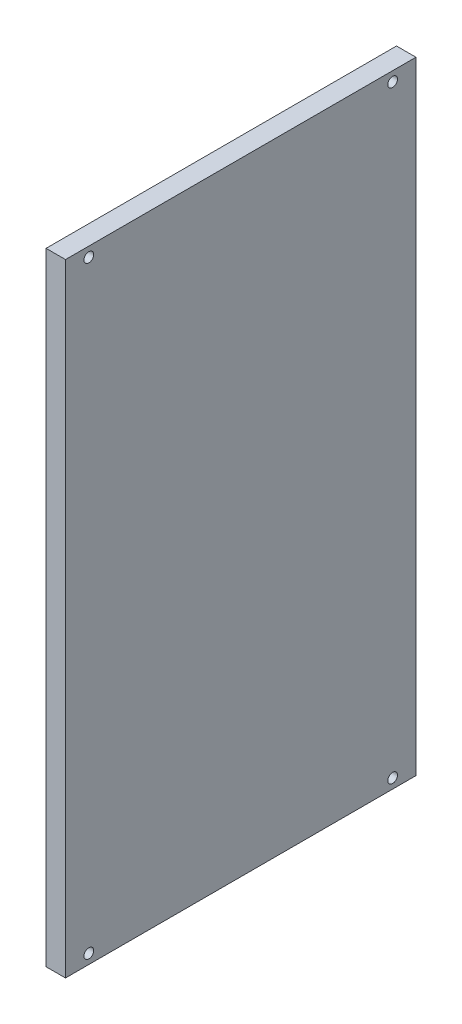
ISO-10303-21;
HEADER;
FILE_DESCRIPTION(('STEP AP214'),'2;1');
FILE_NAME('part.step','',(''),(''),'','','');
FILE_SCHEMA(('AUTOMOTIVE_DESIGN { 1 0 10303 214 1 1 1 1 }'));
ENDSEC;
DATA;
#1=APPLICATION_CONTEXT('core data for automotive mechanical design processes');
#2=APPLICATION_PROTOCOL_DEFINITION('international standard','automotive_design',2000,#1);
#3=PRODUCT_CONTEXT('',#1,'mechanical');
#4=PRODUCT('Part','Part','',(#3));
#5=PRODUCT_RELATED_PRODUCT_CATEGORY('part','',(#4));
#6=PRODUCT_DEFINITION_FORMATION('','',#4);
#7=PRODUCT_DEFINITION_CONTEXT('part definition',#1,'design');
#8=PRODUCT_DEFINITION('design','',#6,#7);
#9=PRODUCT_DEFINITION_SHAPE('','',#8);
#10=(LENGTH_UNIT() NAMED_UNIT(*) SI_UNIT(.MILLI.,.METRE.));
#11=(NAMED_UNIT(*) PLANE_ANGLE_UNIT() SI_UNIT($,.RADIAN.));
#12=(NAMED_UNIT(*) SI_UNIT($,.STERADIAN.) SOLID_ANGLE_UNIT());
#13=UNCERTAINTY_MEASURE_WITH_UNIT(LENGTH_MEASURE(1.E-05),#10,'distance_accuracy_value','');
#14=(GEOMETRIC_REPRESENTATION_CONTEXT(3) GLOBAL_UNCERTAINTY_ASSIGNED_CONTEXT((#13)) GLOBAL_UNIT_ASSIGNED_CONTEXT((#10,
#11,#12)) REPRESENTATION_CONTEXT('',''));
#15=CARTESIAN_POINT('',(0.,0.,0.));
#16=DIRECTION('',(0.,0.,1.));
#17=DIRECTION('',(1.,0.,0.));
#18=AXIS2_PLACEMENT_3D('',#15,#16,#17);
#19=CARTESIAN_POINT('',(10.,0.,0.));
#20=DIRECTION('',(1.,0.,0.));
#21=DIRECTION('',(0.,0.,-1.));
#22=AXIS2_PLACEMENT_3D('',#19,#20,#21);
#23=PLANE('',#22);
#24=CARTESIAN_POINT('',(10.,-155.065,78.15));
#25=DIRECTION('',(1.,0.,0.));
#26=DIRECTION('',(0.,0.,-1.));
#27=AXIS2_PLACEMENT_3D('',#24,#25,#26);
#28=CIRCLE('',#27,2.5);
#29=CARTESIAN_POINT('',(10.,-155.065,75.65));
#30=VERTEX_POINT('',#29);
#31=EDGE_CURVE('E131',#30,#30,#28,.T.);
#32=ORIENTED_EDGE('',*,*,#31,.F.);
#33=EDGE_LOOP('',(#32));
#34=FACE_BOUND('',#33,.T.);
#35=CARTESIAN_POINT('',(10.,155.065,78.15));
#36=DIRECTION('',(1.,0.,0.));
#37=DIRECTION('',(0.,0.,-1.));
#38=AXIS2_PLACEMENT_3D('',#35,#36,#37);
#39=CIRCLE('',#38,2.5);
#40=CARTESIAN_POINT('',(10.,155.065,75.65));
#41=VERTEX_POINT('',#40);
#42=EDGE_CURVE('E110',#41,#41,#39,.T.);
#43=ORIENTED_EDGE('',*,*,#42,.F.);
#44=EDGE_LOOP('',(#43));
#45=FACE_BOUND('',#44,.T.);
#46=DIRECTION('',(0.,0.,1.));
#47=VECTOR('',#46,1.);
#48=CARTESIAN_POINT('',(10.,160.065,-90.15));
#49=LINE('',#48,#47);
#50=CARTESIAN_POINT('',(10.,160.065,-90.15));
#51=VERTEX_POINT('',#50);
#52=CARTESIAN_POINT('',(10.,160.065,90.15));
#53=VERTEX_POINT('',#52);
#54=EDGE_CURVE('E95',#51,#53,#49,.T.);
#55=ORIENTED_EDGE('',*,*,#54,.T.);
#56=DIRECTION('',(0.,-1.,0.));
#57=VECTOR('',#56,1.);
#58=CARTESIAN_POINT('',(10.,160.065,90.15));
#59=LINE('',#58,#57);
#60=CARTESIAN_POINT('',(10.,-160.065,90.15));
#61=VERTEX_POINT('',#60);
#62=EDGE_CURVE('E90',#53,#61,#59,.T.);
#63=ORIENTED_EDGE('',*,*,#62,.T.);
#64=DIRECTION('',(0.,0.,-1.));
#65=VECTOR('',#64,1.);
#66=CARTESIAN_POINT('',(10.,-160.065,90.15));
#67=LINE('',#66,#65);
#68=CARTESIAN_POINT('',(10.,-160.065,-90.15));
#69=VERTEX_POINT('',#68);
#70=EDGE_CURVE('E93',#61,#69,#67,.T.);
#71=ORIENTED_EDGE('',*,*,#70,.T.);
#72=DIRECTION('',(0.,1.,0.));
#73=VECTOR('',#72,1.);
#74=CARTESIAN_POINT('',(10.,-160.065,-90.15));
#75=LINE('',#74,#73);
#76=EDGE_CURVE('E60',#69,#51,#75,.T.);
#77=ORIENTED_EDGE('',*,*,#76,.T.);
#78=EDGE_LOOP('',(#55,#63,#71,#77));
#79=FACE_BOUND('',#78,.T.);
#80=CARTESIAN_POINT('',(10.,155.065,-78.15));
#81=DIRECTION('',(1.,0.,0.));
#82=DIRECTION('',(0.,0.,-1.));
#83=AXIS2_PLACEMENT_3D('',#80,#81,#82);
#84=CIRCLE('',#83,2.50000000000001);
#85=CARTESIAN_POINT('',(10.,155.065,-80.65));
#86=VERTEX_POINT('',#85);
#87=EDGE_CURVE('E125',#86,#86,#84,.T.);
#88=ORIENTED_EDGE('',*,*,#87,.F.);
#89=EDGE_LOOP('',(#88));
#90=FACE_BOUND('',#89,.T.);
#91=CARTESIAN_POINT('',(10.,-155.065,-78.15));
#92=DIRECTION('',(1.,0.,0.));
#93=DIRECTION('',(0.,0.,-1.));
#94=AXIS2_PLACEMENT_3D('',#91,#92,#93);
#95=CIRCLE('',#94,2.5);
#96=CARTESIAN_POINT('',(10.,-155.065,-80.65));
#97=VERTEX_POINT('',#96);
#98=EDGE_CURVE('E137',#97,#97,#95,.T.);
#99=ORIENTED_EDGE('',*,*,#98,.F.);
#100=EDGE_LOOP('',(#99));
#101=FACE_BOUND('',#100,.T.);
#102=ADVANCED_FACE('F43',(#34,#45,#79,#90,#101),#23,.T.);
#103=CARTESIAN_POINT('',(0.,0.,0.));
#104=DIRECTION('',(1.,0.,0.));
#105=DIRECTION('',(0.,0.,-1.));
#106=AXIS2_PLACEMENT_3D('',#103,#104,#105);
#107=PLANE('',#106);
#108=DIRECTION('',(0.,0.,1.));
#109=VECTOR('',#108,1.);
#110=CARTESIAN_POINT('',(0.,160.065,-90.15));
#111=LINE('',#110,#109);
#112=CARTESIAN_POINT('',(0.,160.065,-90.15));
#113=VERTEX_POINT('',#112);
#114=CARTESIAN_POINT('',(0.,160.065,90.15));
#115=VERTEX_POINT('',#114);
#116=EDGE_CURVE('E107',#113,#115,#111,.T.);
#117=ORIENTED_EDGE('',*,*,#116,.F.);
#118=DIRECTION('',(0.,1.,0.));
#119=VECTOR('',#118,1.);
#120=CARTESIAN_POINT('',(0.,-160.065,-90.15));
#121=LINE('',#120,#119);
#122=CARTESIAN_POINT('',(0.,-160.065,-90.15));
#123=VERTEX_POINT('',#122);
#124=EDGE_CURVE('E83',#123,#113,#121,.T.);
#125=ORIENTED_EDGE('',*,*,#124,.F.);
#126=DIRECTION('',(0.,0.,-1.));
#127=VECTOR('',#126,1.);
#128=CARTESIAN_POINT('',(0.,-160.065,90.15));
#129=LINE('',#128,#127);
#130=CARTESIAN_POINT('',(0.,-160.065,90.15));
#131=VERTEX_POINT('',#130);
#132=EDGE_CURVE('E77',#131,#123,#129,.T.);
#133=ORIENTED_EDGE('',*,*,#132,.F.);
#134=DIRECTION('',(0.,-1.,0.));
#135=VECTOR('',#134,1.);
#136=CARTESIAN_POINT('',(0.,160.065,90.15));
#137=LINE('',#136,#135);
#138=EDGE_CURVE('E99',#115,#131,#137,.T.);
#139=ORIENTED_EDGE('',*,*,#138,.F.);
#140=EDGE_LOOP('',(#117,#125,#133,#139));
#141=FACE_BOUND('',#140,.T.);
#142=CARTESIAN_POINT('',(0.,155.065,78.15));
#143=DIRECTION('',(1.,0.,0.));
#144=DIRECTION('',(0.,0.,-1.));
#145=AXIS2_PLACEMENT_3D('',#142,#143,#144);
#146=CIRCLE('',#145,2.5);
#147=CARTESIAN_POINT('',(0.,155.065,75.65));
#148=VERTEX_POINT('',#147);
#149=EDGE_CURVE('E122',#148,#148,#146,.T.);
#150=ORIENTED_EDGE('',*,*,#149,.T.);
#151=EDGE_LOOP('',(#150));
#152=FACE_BOUND('',#151,.T.);
#153=CARTESIAN_POINT('',(0.,155.065,-78.15));
#154=DIRECTION('',(1.,0.,0.));
#155=DIRECTION('',(0.,0.,-1.));
#156=AXIS2_PLACEMENT_3D('',#153,#154,#155);
#157=CIRCLE('',#156,2.50000000000001);
#158=CARTESIAN_POINT('',(0.,155.065,-80.65));
#159=VERTEX_POINT('',#158);
#160=EDGE_CURVE('E128',#159,#159,#157,.T.);
#161=ORIENTED_EDGE('',*,*,#160,.T.);
#162=EDGE_LOOP('',(#161));
#163=FACE_BOUND('',#162,.T.);
#164=CARTESIAN_POINT('',(0.,-155.065,78.15));
#165=DIRECTION('',(1.,0.,0.));
#166=DIRECTION('',(0.,0.,-1.));
#167=AXIS2_PLACEMENT_3D('',#164,#165,#166);
#168=CIRCLE('',#167,2.5);
#169=CARTESIAN_POINT('',(0.,-155.065,75.65));
#170=VERTEX_POINT('',#169);
#171=EDGE_CURVE('E134',#170,#170,#168,.T.);
#172=ORIENTED_EDGE('',*,*,#171,.T.);
#173=EDGE_LOOP('',(#172));
#174=FACE_BOUND('',#173,.T.);
#175=CARTESIAN_POINT('',(0.,-155.065,-78.15));
#176=DIRECTION('',(1.,0.,0.));
#177=DIRECTION('',(0.,0.,-1.));
#178=AXIS2_PLACEMENT_3D('',#175,#176,#177);
#179=CIRCLE('',#178,2.5);
#180=CARTESIAN_POINT('',(0.,-155.065,-80.65));
#181=VERTEX_POINT('',#180);
#182=EDGE_CURVE('E140',#181,#181,#179,.T.);
#183=ORIENTED_EDGE('',*,*,#182,.T.);
#184=EDGE_LOOP('',(#183));
#185=FACE_BOUND('',#184,.T.);
#186=ADVANCED_FACE('F118',(#141,#152,#163,#174,#185),#107,.F.);
#187=CARTESIAN_POINT('',(10.,160.065,-90.15));
#188=DIRECTION('',(0.,-1.,0.));
#189=DIRECTION('',(0.,0.,-1.));
#190=AXIS2_PLACEMENT_3D('',#187,#188,#189);
#191=PLANE('',#190);
#192=ORIENTED_EDGE('',*,*,#116,.T.);
#193=DIRECTION('',(-1.,0.,0.));
#194=VECTOR('',#193,1.);
#195=CARTESIAN_POINT('',(10.,160.065,90.15));
#196=LINE('',#195,#194);
#197=EDGE_CURVE('E11',#53,#115,#196,.T.);
#198=ORIENTED_EDGE('',*,*,#197,.F.);
#199=ORIENTED_EDGE('',*,*,#54,.F.);
#200=DIRECTION('',(-1.,0.,0.));
#201=VECTOR('',#200,1.);
#202=CARTESIAN_POINT('',(10.,160.065,-90.15));
#203=LINE('',#202,#201);
#204=EDGE_CURVE('E103',#51,#113,#203,.T.);
#205=ORIENTED_EDGE('',*,*,#204,.T.);
#206=EDGE_LOOP('',(#192,#198,#199,#205));
#207=FACE_BOUND('',#206,.T.);
#208=ADVANCED_FACE('F45',(#207),#191,.F.);
#209=CARTESIAN_POINT('',(10.,160.065,90.15));
#210=DIRECTION('',(0.,0.,-1.));
#211=DIRECTION('',(-1.,0.,0.));
#212=AXIS2_PLACEMENT_3D('',#209,#210,#211);
#213=PLANE('',#212);
#214=ORIENTED_EDGE('',*,*,#138,.T.);
#215=DIRECTION('',(-1.,0.,0.));
#216=VECTOR('',#215,1.);
#217=CARTESIAN_POINT('',(10.,-160.065,90.15));
#218=LINE('',#217,#216);
#219=EDGE_CURVE('E52',#61,#131,#218,.T.);
#220=ORIENTED_EDGE('',*,*,#219,.F.);
#221=ORIENTED_EDGE('',*,*,#62,.F.);
#222=ORIENTED_EDGE('',*,*,#197,.T.);
#223=EDGE_LOOP('',(#214,#220,#221,#222));
#224=FACE_BOUND('',#223,.T.);
#225=ADVANCED_FACE('F98',(#224),#213,.F.);
#226=CARTESIAN_POINT('',(10.,-160.065,90.15));
#227=DIRECTION('',(0.,1.,0.));
#228=DIRECTION('',(0.,0.,1.));
#229=AXIS2_PLACEMENT_3D('',#226,#227,#228);
#230=PLANE('',#229);
#231=ORIENTED_EDGE('',*,*,#132,.T.);
#232=DIRECTION('',(-1.,0.,0.));
#233=VECTOR('',#232,1.);
#234=CARTESIAN_POINT('',(10.,-160.065,-90.15));
#235=LINE('',#234,#233);
#236=EDGE_CURVE('E100',#69,#123,#235,.T.);
#237=ORIENTED_EDGE('',*,*,#236,.F.);
#238=ORIENTED_EDGE('',*,*,#70,.F.);
#239=ORIENTED_EDGE('',*,*,#219,.T.);
#240=EDGE_LOOP('',(#231,#237,#238,#239));
#241=FACE_BOUND('',#240,.T.);
#242=ADVANCED_FACE('F101',(#241),#230,.F.);
#243=CARTESIAN_POINT('',(10.,-160.065,-90.15));
#244=DIRECTION('',(0.,0.,1.));
#245=DIRECTION('',(1.,0.,0.));
#246=AXIS2_PLACEMENT_3D('',#243,#244,#245);
#247=PLANE('',#246);
#248=ORIENTED_EDGE('',*,*,#124,.T.);
#249=ORIENTED_EDGE('',*,*,#204,.F.);
#250=ORIENTED_EDGE('',*,*,#76,.F.);
#251=ORIENTED_EDGE('',*,*,#236,.T.);
#252=EDGE_LOOP('',(#248,#249,#250,#251));
#253=FACE_BOUND('',#252,.T.);
#254=ADVANCED_FACE('F115',(#253),#247,.F.);
#255=CARTESIAN_POINT('',(10.,155.065,78.15));
#256=DIRECTION('',(-1.,0.,0.));
#257=DIRECTION('',(0.,0.,1.));
#258=AXIS2_PLACEMENT_3D('',#255,#256,#257);
#259=CYLINDRICAL_SURFACE('',#258,2.5);
#260=ORIENTED_EDGE('',*,*,#42,.T.);
#261=EDGE_LOOP('',(#260));
#262=FACE_BOUND('',#261,.T.);
#263=ORIENTED_EDGE('',*,*,#149,.F.);
#264=EDGE_LOOP('',(#263));
#265=FACE_BOUND('',#264,.T.);
#266=ADVANCED_FACE('F159',(#262,#265),#259,.F.);
#267=CARTESIAN_POINT('',(10.,155.065,-78.15));
#268=DIRECTION('',(-1.,0.,0.));
#269=DIRECTION('',(0.,0.,1.));
#270=AXIS2_PLACEMENT_3D('',#267,#268,#269);
#271=CYLINDRICAL_SURFACE('',#270,2.50000000000001);
#272=ORIENTED_EDGE('',*,*,#87,.T.);
#273=EDGE_LOOP('',(#272));
#274=FACE_BOUND('',#273,.T.);
#275=ORIENTED_EDGE('',*,*,#160,.F.);
#276=EDGE_LOOP('',(#275));
#277=FACE_BOUND('',#276,.T.);
#278=ADVANCED_FACE('F204',(#274,#277),#271,.F.);
#279=CARTESIAN_POINT('',(10.,-155.065,78.15));
#280=DIRECTION('',(-1.,0.,0.));
#281=DIRECTION('',(0.,0.,1.));
#282=AXIS2_PLACEMENT_3D('',#279,#280,#281);
#283=CYLINDRICAL_SURFACE('',#282,2.5);
#284=ORIENTED_EDGE('',*,*,#31,.T.);
#285=EDGE_LOOP('',(#284));
#286=FACE_BOUND('',#285,.T.);
#287=ORIENTED_EDGE('',*,*,#171,.F.);
#288=EDGE_LOOP('',(#287));
#289=FACE_BOUND('',#288,.T.);
#290=ADVANCED_FACE('F212',(#286,#289),#283,.F.);
#291=CARTESIAN_POINT('',(10.,-155.065,-78.15));
#292=DIRECTION('',(-1.,0.,0.));
#293=DIRECTION('',(0.,0.,1.));
#294=AXIS2_PLACEMENT_3D('',#291,#292,#293);
#295=CYLINDRICAL_SURFACE('',#294,2.5);
#296=ORIENTED_EDGE('',*,*,#98,.T.);
#297=EDGE_LOOP('',(#296));
#298=FACE_BOUND('',#297,.T.);
#299=ORIENTED_EDGE('',*,*,#182,.F.);
#300=EDGE_LOOP('',(#299));
#301=FACE_BOUND('',#300,.T.);
#302=ADVANCED_FACE('F146',(#298,#301),#295,.F.);
#303=CLOSED_SHELL('',(#102,#186,#208,#225,#242,#254,#266,#278,#290,#302));
#304=MANIFOLD_SOLID_BREP('B2',#303);
#305=ADVANCED_BREP_SHAPE_REPRESENTATION('',(#18,#304),#14);
#306=SHAPE_DEFINITION_REPRESENTATION(#9,#305);
ENDSEC;
END-ISO-10303-21;
